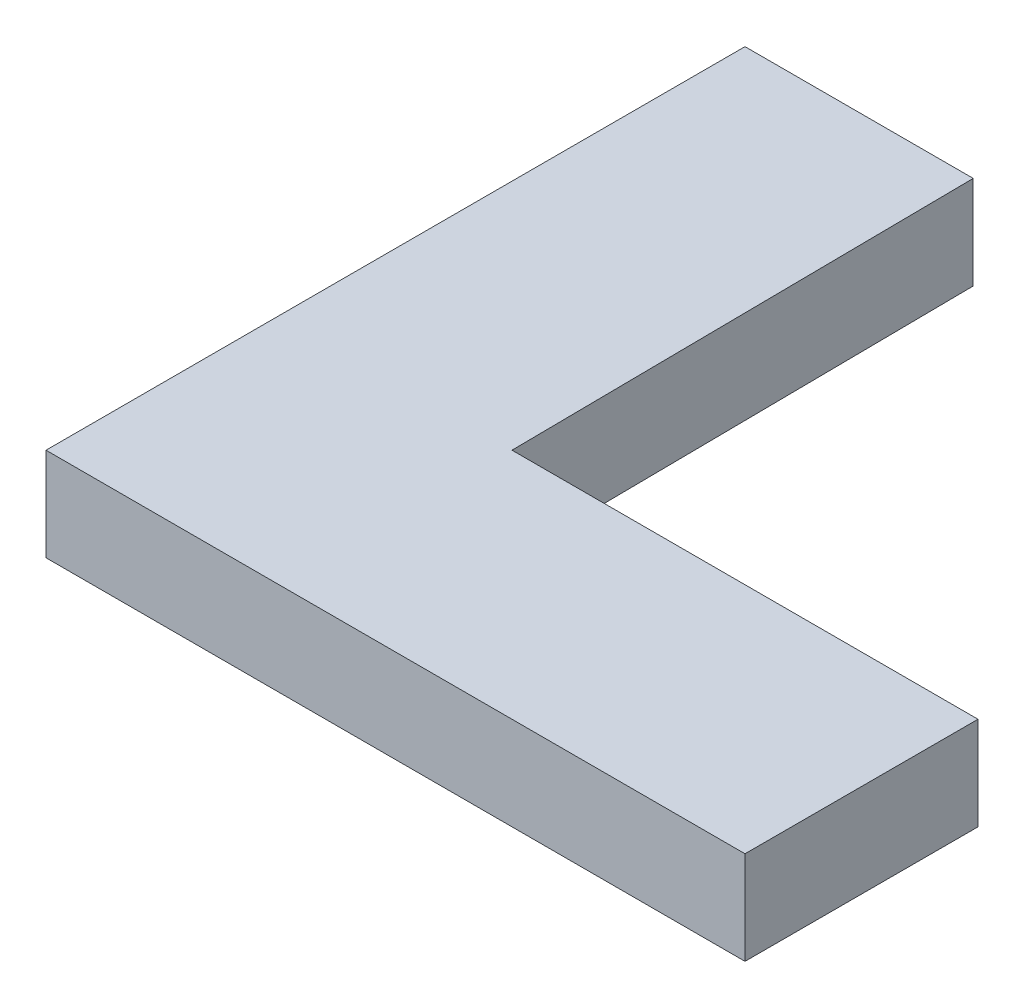
ISO-10303-21;
HEADER;
FILE_DESCRIPTION(('STEP AP214'),'2;1');
FILE_NAME('part.step','',(''),(''),'','','');
FILE_SCHEMA(('AUTOMOTIVE_DESIGN { 1 0 10303 214 1 1 1 1 }'));
ENDSEC;
DATA;
#1=APPLICATION_CONTEXT('core data for automotive mechanical design processes');
#2=APPLICATION_PROTOCOL_DEFINITION('international standard','automotive_design',2000,#1);
#3=PRODUCT_CONTEXT('',#1,'mechanical');
#4=PRODUCT('Part','Part','',(#3));
#5=PRODUCT_RELATED_PRODUCT_CATEGORY('part','',(#4));
#6=PRODUCT_DEFINITION_FORMATION('','',#4);
#7=PRODUCT_DEFINITION_CONTEXT('part definition',#1,'design');
#8=PRODUCT_DEFINITION('design','',#6,#7);
#9=PRODUCT_DEFINITION_SHAPE('','',#8);
#10=(LENGTH_UNIT() NAMED_UNIT(*) SI_UNIT(.MILLI.,.METRE.));
#11=(NAMED_UNIT(*) PLANE_ANGLE_UNIT() SI_UNIT($,.RADIAN.));
#12=(NAMED_UNIT(*) SI_UNIT($,.STERADIAN.) SOLID_ANGLE_UNIT());
#13=UNCERTAINTY_MEASURE_WITH_UNIT(LENGTH_MEASURE(1.E-05),#10,'distance_accuracy_value','');
#14=(GEOMETRIC_REPRESENTATION_CONTEXT(3) GLOBAL_UNCERTAINTY_ASSIGNED_CONTEXT((#13)) GLOBAL_UNIT_ASSIGNED_CONTEXT((#10,
#11,#12)) REPRESENTATION_CONTEXT('',''));
#15=CARTESIAN_POINT('',(0.,0.,0.));
#16=DIRECTION('',(0.,0.,1.));
#17=DIRECTION('',(1.,0.,0.));
#18=AXIS2_PLACEMENT_3D('',#15,#16,#17);
#19=CARTESIAN_POINT('',(0.,5.08,-38.1));
#20=DIRECTION('',(1.,0.,0.));
#21=DIRECTION('',(0.,0.,-1.));
#22=AXIS2_PLACEMENT_3D('',#19,#20,#21);
#23=PLANE('',#22);
#24=DIRECTION('',(0.,0.,1.));
#25=VECTOR('',#24,1.);
#26=CARTESIAN_POINT('',(0.,0.,-38.1));
#27=LINE('',#26,#25);
#28=CARTESIAN_POINT('',(0.,0.,-38.1));
#29=VERTEX_POINT('',#28);
#30=CARTESIAN_POINT('',(0.,0.,0.));
#31=VERTEX_POINT('',#30);
#32=EDGE_CURVE('E117',#29,#31,#27,.T.);
#33=ORIENTED_EDGE('',*,*,#32,.T.);
#34=DIRECTION('',(0.,-1.,0.));
#35=VECTOR('',#34,1.);
#36=CARTESIAN_POINT('',(0.,5.08,0.));
#37=LINE('',#36,#35);
#38=CARTESIAN_POINT('',(0.,5.08,0.));
#39=VERTEX_POINT('',#38);
#40=EDGE_CURVE('E11',#39,#31,#37,.T.);
#41=ORIENTED_EDGE('',*,*,#40,.F.);
#42=DIRECTION('',(0.,0.,1.));
#43=VECTOR('',#42,1.);
#44=CARTESIAN_POINT('',(0.,5.08,-38.1));
#45=LINE('',#44,#43);
#46=CARTESIAN_POINT('',(0.,5.08,-38.1));
#47=VERTEX_POINT('',#46);
#48=EDGE_CURVE('E127',#47,#39,#45,.T.);
#49=ORIENTED_EDGE('',*,*,#48,.F.);
#50=DIRECTION('',(0.,-1.,0.));
#51=VECTOR('',#50,1.);
#52=CARTESIAN_POINT('',(0.,5.08,-38.1));
#53=LINE('',#52,#51);
#54=EDGE_CURVE('E113',#47,#29,#53,.T.);
#55=ORIENTED_EDGE('',*,*,#54,.T.);
#56=EDGE_LOOP('',(#33,#41,#49,#55));
#57=FACE_BOUND('',#56,.T.);
#58=ADVANCED_FACE('F33',(#57),#23,.F.);
#59=CARTESIAN_POINT('',(0.,5.08,0.));
#60=DIRECTION('',(0.,0.,-1.));
#61=DIRECTION('',(-1.,0.,0.));
#62=AXIS2_PLACEMENT_3D('',#59,#60,#61);
#63=PLANE('',#62);
#64=DIRECTION('',(1.,0.,0.));
#65=VECTOR('',#64,1.);
#66=CARTESIAN_POINT('',(0.,0.,0.));
#67=LINE('',#66,#65);
#68=CARTESIAN_POINT('',(38.1,0.,0.));
#69=VERTEX_POINT('',#68);
#70=EDGE_CURVE('E120',#31,#69,#67,.T.);
#71=ORIENTED_EDGE('',*,*,#70,.T.);
#72=DIRECTION('',(0.,-1.,0.));
#73=VECTOR('',#72,1.);
#74=CARTESIAN_POINT('',(38.1,5.08,0.));
#75=LINE('',#74,#73);
#76=CARTESIAN_POINT('',(38.1,5.08,0.));
#77=VERTEX_POINT('',#76);
#78=EDGE_CURVE('E41',#77,#69,#75,.T.);
#79=ORIENTED_EDGE('',*,*,#78,.F.);
#80=DIRECTION('',(1.,0.,0.));
#81=VECTOR('',#80,1.);
#82=CARTESIAN_POINT('',(0.,5.08,0.));
#83=LINE('',#82,#81);
#84=EDGE_CURVE('E86',#39,#77,#83,.T.);
#85=ORIENTED_EDGE('',*,*,#84,.F.);
#86=ORIENTED_EDGE('',*,*,#40,.T.);
#87=EDGE_LOOP('',(#71,#79,#85,#86));
#88=FACE_BOUND('',#87,.T.);
#89=ADVANCED_FACE('F151',(#88),#63,.F.);
#90=CARTESIAN_POINT('',(38.1,5.08,0.));
#91=DIRECTION('',(-1.,0.,0.));
#92=DIRECTION('',(0.,0.,1.));
#93=AXIS2_PLACEMENT_3D('',#90,#91,#92);
#94=PLANE('',#93);
#95=DIRECTION('',(0.,0.,-1.));
#96=VECTOR('',#95,1.);
#97=CARTESIAN_POINT('',(38.1,0.,0.));
#98=LINE('',#97,#96);
#99=CARTESIAN_POINT('',(38.1,0.,-12.7));
#100=VERTEX_POINT('',#99);
#101=EDGE_CURVE('E122',#69,#100,#98,.T.);
#102=ORIENTED_EDGE('',*,*,#101,.T.);
#103=DIRECTION('',(0.,-1.,0.));
#104=VECTOR('',#103,1.);
#105=CARTESIAN_POINT('',(38.1,5.08,-12.7));
#106=LINE('',#105,#104);
#107=CARTESIAN_POINT('',(38.1,5.08,-12.7));
#108=VERTEX_POINT('',#107);
#109=EDGE_CURVE('E108',#108,#100,#106,.T.);
#110=ORIENTED_EDGE('',*,*,#109,.F.);
#111=DIRECTION('',(0.,0.,-1.));
#112=VECTOR('',#111,1.);
#113=CARTESIAN_POINT('',(38.1,5.08,0.));
#114=LINE('',#113,#112);
#115=EDGE_CURVE('E99',#77,#108,#114,.T.);
#116=ORIENTED_EDGE('',*,*,#115,.F.);
#117=ORIENTED_EDGE('',*,*,#78,.T.);
#118=EDGE_LOOP('',(#102,#110,#116,#117));
#119=FACE_BOUND('',#118,.T.);
#120=ADVANCED_FACE('F133',(#119),#94,.F.);
#121=CARTESIAN_POINT('',(38.1,5.08,-12.7));
#122=DIRECTION('',(0.,0.,1.));
#123=DIRECTION('',(1.,0.,0.));
#124=AXIS2_PLACEMENT_3D('',#121,#122,#123);
#125=PLANE('',#124);
#126=DIRECTION('',(-1.,0.,0.));
#127=VECTOR('',#126,1.);
#128=CARTESIAN_POINT('',(38.1,0.,-12.7));
#129=LINE('',#128,#127);
#130=CARTESIAN_POINT('',(12.7,0.,-12.7));
#131=VERTEX_POINT('',#130);
#132=EDGE_CURVE('E107',#100,#131,#129,.T.);
#133=ORIENTED_EDGE('',*,*,#132,.T.);
#134=DIRECTION('',(0.,-1.,0.));
#135=VECTOR('',#134,1.);
#136=CARTESIAN_POINT('',(12.7,5.08,-12.7));
#137=LINE('',#136,#135);
#138=CARTESIAN_POINT('',(12.7,5.08,-12.7));
#139=VERTEX_POINT('',#138);
#140=EDGE_CURVE('E104',#139,#131,#137,.T.);
#141=ORIENTED_EDGE('',*,*,#140,.F.);
#142=DIRECTION('',(-1.,0.,0.));
#143=VECTOR('',#142,1.);
#144=CARTESIAN_POINT('',(38.1,5.08,-12.7));
#145=LINE('',#144,#143);
#146=EDGE_CURVE('E93',#108,#139,#145,.T.);
#147=ORIENTED_EDGE('',*,*,#146,.F.);
#148=ORIENTED_EDGE('',*,*,#109,.T.);
#149=EDGE_LOOP('',(#133,#141,#147,#148));
#150=FACE_BOUND('',#149,.T.);
#151=ADVANCED_FACE('F105',(#150),#125,.F.);
#152=CARTESIAN_POINT('',(12.7,5.08,-12.7));
#153=DIRECTION('',(-0.999947446795815,0.,0.0102520069513538));
#154=DIRECTION('',(0.0102520069513538,0.,0.999947446795815));
#155=AXIS2_PLACEMENT_3D('',#152,#153,#154);
#156=PLANE('',#155);
#157=DIRECTION('',(-0.0102520069513538,0.,-0.999947446795815));
#158=VECTOR('',#157,1.);
#159=CARTESIAN_POINT('',(12.7,0.,-12.7));
#160=LINE('',#159,#158);
#161=CARTESIAN_POINT('',(12.4395853378107,0.,-38.1));
#162=VERTEX_POINT('',#161);
#163=EDGE_CURVE('E72',#131,#162,#160,.T.);
#164=ORIENTED_EDGE('',*,*,#163,.T.);
#165=DIRECTION('',(0.,-1.,0.));
#166=VECTOR('',#165,1.);
#167=CARTESIAN_POINT('',(12.4395853378107,5.08,-38.1));
#168=LINE('',#167,#166);
#169=CARTESIAN_POINT('',(12.4395853378107,5.08,-38.1));
#170=VERTEX_POINT('',#169);
#171=EDGE_CURVE('E109',#170,#162,#168,.T.);
#172=ORIENTED_EDGE('',*,*,#171,.F.);
#173=DIRECTION('',(-0.0102520069513538,0.,-0.999947446795815));
#174=VECTOR('',#173,1.);
#175=CARTESIAN_POINT('',(12.7,5.08,-12.7));
#176=LINE('',#175,#174);
#177=EDGE_CURVE('E97',#139,#170,#176,.T.);
#178=ORIENTED_EDGE('',*,*,#177,.F.);
#179=ORIENTED_EDGE('',*,*,#140,.T.);
#180=EDGE_LOOP('',(#164,#172,#178,#179));
#181=FACE_BOUND('',#180,.T.);
#182=ADVANCED_FACE('F111',(#181),#156,.F.);
#183=CARTESIAN_POINT('',(12.4395853378107,5.08,-38.1));
#184=DIRECTION('',(0.,0.,1.));
#185=DIRECTION('',(1.,0.,0.));
#186=AXIS2_PLACEMENT_3D('',#183,#184,#185);
#187=PLANE('',#186);
#188=DIRECTION('',(-1.,0.,0.));
#189=VECTOR('',#188,1.);
#190=CARTESIAN_POINT('',(12.4395853378107,0.,-38.1));
#191=LINE('',#190,#189);
#192=EDGE_CURVE('E78',#162,#29,#191,.T.);
#193=ORIENTED_EDGE('',*,*,#192,.T.);
#194=ORIENTED_EDGE('',*,*,#54,.F.);
#195=DIRECTION('',(-1.,0.,0.));
#196=VECTOR('',#195,1.);
#197=CARTESIAN_POINT('',(12.4395853378107,5.08,-38.1));
#198=LINE('',#197,#196);
#199=EDGE_CURVE('E49',#170,#47,#198,.T.);
#200=ORIENTED_EDGE('',*,*,#199,.F.);
#201=ORIENTED_EDGE('',*,*,#171,.T.);
#202=EDGE_LOOP('',(#193,#194,#200,#201));
#203=FACE_BOUND('',#202,.T.);
#204=ADVANCED_FACE('F140',(#203),#187,.F.);
#205=CARTESIAN_POINT('',(0.,5.08,0.));
#206=DIRECTION('',(0.,1.,0.));
#207=DIRECTION('',(0.,0.,1.));
#208=AXIS2_PLACEMENT_3D('',#205,#206,#207);
#209=PLANE('',#208);
#210=ORIENTED_EDGE('',*,*,#48,.T.);
#211=ORIENTED_EDGE('',*,*,#84,.T.);
#212=ORIENTED_EDGE('',*,*,#115,.T.);
#213=ORIENTED_EDGE('',*,*,#146,.T.);
#214=ORIENTED_EDGE('',*,*,#177,.T.);
#215=ORIENTED_EDGE('',*,*,#199,.T.);
#216=EDGE_LOOP('',(#210,#211,#212,#213,#214,#215));
#217=FACE_BOUND('',#216,.T.);
#218=ADVANCED_FACE('F95',(#217),#209,.T.);
#219=CARTESIAN_POINT('',(0.,0.,0.));
#220=DIRECTION('',(0.,1.,0.));
#221=DIRECTION('',(0.,0.,1.));
#222=AXIS2_PLACEMENT_3D('',#219,#220,#221);
#223=PLANE('',#222);
#224=ORIENTED_EDGE('',*,*,#32,.F.);
#225=ORIENTED_EDGE('',*,*,#192,.F.);
#226=ORIENTED_EDGE('',*,*,#163,.F.);
#227=ORIENTED_EDGE('',*,*,#132,.F.);
#228=ORIENTED_EDGE('',*,*,#101,.F.);
#229=ORIENTED_EDGE('',*,*,#70,.F.);
#230=EDGE_LOOP('',(#224,#225,#226,#227,#228,#229));
#231=FACE_BOUND('',#230,.T.);
#232=ADVANCED_FACE('F136',(#231),#223,.F.);
#233=CLOSED_SHELL('',(#58,#89,#120,#151,#182,#204,#218,#232));
#234=MANIFOLD_SOLID_BREP('B2',#233);
#235=ADVANCED_BREP_SHAPE_REPRESENTATION('',(#18,#234),#14);
#236=SHAPE_DEFINITION_REPRESENTATION(#9,#235);
ENDSEC;
END-ISO-10303-21;
